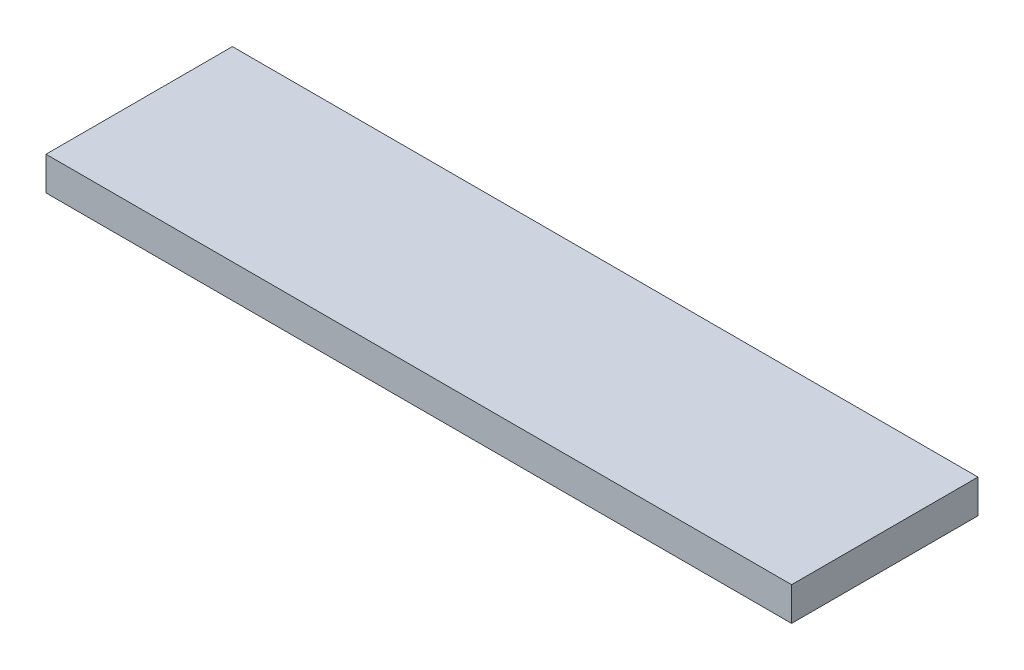
ISO-10303-21;
HEADER;
FILE_DESCRIPTION(('STEP AP214'),'2;1');
FILE_NAME('part.step','',(''),(''),'','','');
FILE_SCHEMA(('AUTOMOTIVE_DESIGN { 1 0 10303 214 1 1 1 1 }'));
ENDSEC;
DATA;
#1=APPLICATION_CONTEXT('core data for automotive mechanical design processes');
#2=APPLICATION_PROTOCOL_DEFINITION('international standard','automotive_design',2000,#1);
#3=PRODUCT_CONTEXT('',#1,'mechanical');
#4=PRODUCT('Part','Part','',(#3));
#5=PRODUCT_RELATED_PRODUCT_CATEGORY('part','',(#4));
#6=PRODUCT_DEFINITION_FORMATION('','',#4);
#7=PRODUCT_DEFINITION_CONTEXT('part definition',#1,'design');
#8=PRODUCT_DEFINITION('design','',#6,#7);
#9=PRODUCT_DEFINITION_SHAPE('','',#8);
#10=(LENGTH_UNIT() NAMED_UNIT(*) SI_UNIT(.MILLI.,.METRE.));
#11=(NAMED_UNIT(*) PLANE_ANGLE_UNIT() SI_UNIT($,.RADIAN.));
#12=(NAMED_UNIT(*) SI_UNIT($,.STERADIAN.) SOLID_ANGLE_UNIT());
#13=UNCERTAINTY_MEASURE_WITH_UNIT(LENGTH_MEASURE(1.E-05),#10,'distance_accuracy_value','');
#14=(GEOMETRIC_REPRESENTATION_CONTEXT(3) GLOBAL_UNCERTAINTY_ASSIGNED_CONTEXT((#13)) GLOBAL_UNIT_ASSIGNED_CONTEXT((#10,
#11,#12)) REPRESENTATION_CONTEXT('',''));
#15=CARTESIAN_POINT('',(0.,0.,0.));
#16=DIRECTION('',(0.,0.,1.));
#17=DIRECTION('',(1.,0.,0.));
#18=AXIS2_PLACEMENT_3D('',#15,#16,#17);
#19=CARTESIAN_POINT('',(0.,18.,0.));
#20=DIRECTION('',(1.,0.,0.));
#21=DIRECTION('',(0.,0.,-1.));
#22=AXIS2_PLACEMENT_3D('',#19,#20,#21);
#23=PLANE('',#22);
#24=DIRECTION('',(0.,0.,1.));
#25=VECTOR('',#24,1.);
#26=CARTESIAN_POINT('',(0.,0.,0.));
#27=LINE('',#26,#25);
#28=CARTESIAN_POINT('',(0.,0.,-100.));
#29=VERTEX_POINT('',#28);
#30=CARTESIAN_POINT('',(0.,0.,0.));
#31=VERTEX_POINT('',#30);
#32=EDGE_CURVE('E95',#29,#31,#27,.T.);
#33=ORIENTED_EDGE('',*,*,#32,.T.);
#34=DIRECTION('',(0.,-1.,0.));
#35=VECTOR('',#34,1.);
#36=CARTESIAN_POINT('',(0.,18.,0.));
#37=LINE('',#36,#35);
#38=CARTESIAN_POINT('',(0.,18.,0.));
#39=VERTEX_POINT('',#38);
#40=EDGE_CURVE('E11',#39,#31,#37,.T.);
#41=ORIENTED_EDGE('',*,*,#40,.F.);
#42=DIRECTION('',(0.,0.,1.));
#43=VECTOR('',#42,1.);
#44=CARTESIAN_POINT('',(0.,18.,0.));
#45=LINE('',#44,#43);
#46=CARTESIAN_POINT('',(0.,18.,-100.));
#47=VERTEX_POINT('',#46);
#48=EDGE_CURVE('E83',#47,#39,#45,.T.);
#49=ORIENTED_EDGE('',*,*,#48,.F.);
#50=DIRECTION('',(0.,-1.,0.));
#51=VECTOR('',#50,1.);
#52=CARTESIAN_POINT('',(0.,18.,-100.));
#53=LINE('',#52,#51);
#54=EDGE_CURVE('E91',#47,#29,#53,.T.);
#55=ORIENTED_EDGE('',*,*,#54,.T.);
#56=EDGE_LOOP('',(#33,#41,#49,#55));
#57=FACE_BOUND('',#56,.T.);
#58=ADVANCED_FACE('F32',(#57),#23,.F.);
#59=CARTESIAN_POINT('',(0.,18.,0.));
#60=DIRECTION('',(0.,0.,-1.));
#61=DIRECTION('',(-1.,0.,0.));
#62=AXIS2_PLACEMENT_3D('',#59,#60,#61);
#63=PLANE('',#62);
#64=DIRECTION('',(1.,0.,0.));
#65=VECTOR('',#64,1.);
#66=CARTESIAN_POINT('',(0.,0.,0.));
#67=LINE('',#66,#65);
#68=CARTESIAN_POINT('',(400.,0.,0.));
#69=VERTEX_POINT('',#68);
#70=EDGE_CURVE('E87',#31,#69,#67,.T.);
#71=ORIENTED_EDGE('',*,*,#70,.T.);
#72=DIRECTION('',(0.,-1.,0.));
#73=VECTOR('',#72,1.);
#74=CARTESIAN_POINT('',(400.,18.,0.));
#75=LINE('',#74,#73);
#76=CARTESIAN_POINT('',(400.,18.,0.));
#77=VERTEX_POINT('',#76);
#78=EDGE_CURVE('E40',#77,#69,#75,.T.);
#79=ORIENTED_EDGE('',*,*,#78,.F.);
#80=DIRECTION('',(1.,0.,0.));
#81=VECTOR('',#80,1.);
#82=CARTESIAN_POINT('',(0.,18.,0.));
#83=LINE('',#82,#81);
#84=EDGE_CURVE('E78',#39,#77,#83,.T.);
#85=ORIENTED_EDGE('',*,*,#84,.F.);
#86=ORIENTED_EDGE('',*,*,#40,.T.);
#87=EDGE_LOOP('',(#71,#79,#85,#86));
#88=FACE_BOUND('',#87,.T.);
#89=ADVANCED_FACE('F86',(#88),#63,.F.);
#90=CARTESIAN_POINT('',(400.,18.,0.));
#91=DIRECTION('',(-1.,0.,0.));
#92=DIRECTION('',(0.,0.,1.));
#93=AXIS2_PLACEMENT_3D('',#90,#91,#92);
#94=PLANE('',#93);
#95=DIRECTION('',(0.,0.,-1.));
#96=VECTOR('',#95,1.);
#97=CARTESIAN_POINT('',(400.,0.,0.));
#98=LINE('',#97,#96);
#99=CARTESIAN_POINT('',(400.,0.,-100.));
#100=VERTEX_POINT('',#99);
#101=EDGE_CURVE('E65',#69,#100,#98,.T.);
#102=ORIENTED_EDGE('',*,*,#101,.T.);
#103=DIRECTION('',(0.,-1.,0.));
#104=VECTOR('',#103,1.);
#105=CARTESIAN_POINT('',(400.,18.,-100.));
#106=LINE('',#105,#104);
#107=CARTESIAN_POINT('',(400.,18.,-100.));
#108=VERTEX_POINT('',#107);
#109=EDGE_CURVE('E88',#108,#100,#106,.T.);
#110=ORIENTED_EDGE('',*,*,#109,.F.);
#111=DIRECTION('',(0.,0.,-1.));
#112=VECTOR('',#111,1.);
#113=CARTESIAN_POINT('',(400.,18.,0.));
#114=LINE('',#113,#112);
#115=EDGE_CURVE('E81',#77,#108,#114,.T.);
#116=ORIENTED_EDGE('',*,*,#115,.F.);
#117=ORIENTED_EDGE('',*,*,#78,.T.);
#118=EDGE_LOOP('',(#102,#110,#116,#117));
#119=FACE_BOUND('',#118,.T.);
#120=ADVANCED_FACE('F89',(#119),#94,.F.);
#121=CARTESIAN_POINT('',(0.,18.,-100.));
#122=DIRECTION('',(0.,0.,1.));
#123=DIRECTION('',(1.,0.,0.));
#124=AXIS2_PLACEMENT_3D('',#121,#122,#123);
#125=PLANE('',#124);
#126=DIRECTION('',(-1.,0.,0.));
#127=VECTOR('',#126,1.);
#128=CARTESIAN_POINT('',(0.,0.,-100.));
#129=LINE('',#128,#127);
#130=EDGE_CURVE('E71',#100,#29,#129,.T.);
#131=ORIENTED_EDGE('',*,*,#130,.T.);
#132=ORIENTED_EDGE('',*,*,#54,.F.);
#133=DIRECTION('',(-1.,0.,0.));
#134=VECTOR('',#133,1.);
#135=CARTESIAN_POINT('',(0.,18.,-100.));
#136=LINE('',#135,#134);
#137=EDGE_CURVE('E48',#108,#47,#136,.T.);
#138=ORIENTED_EDGE('',*,*,#137,.F.);
#139=ORIENTED_EDGE('',*,*,#109,.T.);
#140=EDGE_LOOP('',(#131,#132,#138,#139));
#141=FACE_BOUND('',#140,.T.);
#142=ADVANCED_FACE('F102',(#141),#125,.F.);
#143=CARTESIAN_POINT('',(0.,18.,0.));
#144=DIRECTION('',(0.,-1.,0.));
#145=DIRECTION('',(0.,0.,-1.));
#146=AXIS2_PLACEMENT_3D('',#143,#144,#145);
#147=PLANE('',#146);
#148=ORIENTED_EDGE('',*,*,#48,.T.);
#149=ORIENTED_EDGE('',*,*,#84,.T.);
#150=ORIENTED_EDGE('',*,*,#115,.T.);
#151=ORIENTED_EDGE('',*,*,#137,.T.);
#152=EDGE_LOOP('',(#148,#149,#150,#151));
#153=FACE_BOUND('',#152,.T.);
#154=ADVANCED_FACE('F79',(#153),#147,.F.);
#155=CARTESIAN_POINT('',(0.,0.,0.));
#156=DIRECTION('',(0.,-1.,0.));
#157=DIRECTION('',(0.,0.,-1.));
#158=AXIS2_PLACEMENT_3D('',#155,#156,#157);
#159=PLANE('',#158);
#160=ORIENTED_EDGE('',*,*,#32,.F.);
#161=ORIENTED_EDGE('',*,*,#130,.F.);
#162=ORIENTED_EDGE('',*,*,#101,.F.);
#163=ORIENTED_EDGE('',*,*,#70,.F.);
#164=EDGE_LOOP('',(#160,#161,#162,#163));
#165=FACE_BOUND('',#164,.T.);
#166=ADVANCED_FACE('F105',(#165),#159,.T.);
#167=CLOSED_SHELL('',(#58,#89,#120,#142,#154,#166));
#168=MANIFOLD_SOLID_BREP('B2',#167);
#169=ADVANCED_BREP_SHAPE_REPRESENTATION('',(#18,#168),#14);
#170=SHAPE_DEFINITION_REPRESENTATION(#9,#169);
ENDSEC;
END-ISO-10303-21;
